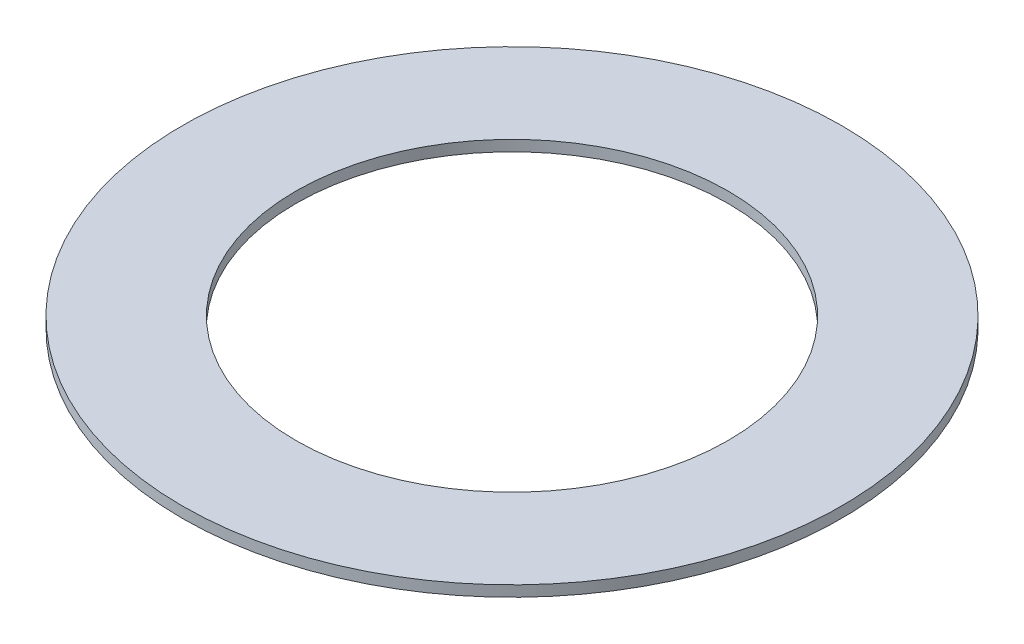
ISO-10303-21;
HEADER;
FILE_DESCRIPTION(('STEP AP214'),'2;1');
FILE_NAME('part.step','',(''),(''),'','','');
FILE_SCHEMA(('AUTOMOTIVE_DESIGN { 1 0 10303 214 1 1 1 1 }'));
ENDSEC;
DATA;
#1=APPLICATION_CONTEXT('core data for automotive mechanical design processes');
#2=APPLICATION_PROTOCOL_DEFINITION('international standard','automotive_design',2000,#1);
#3=PRODUCT_CONTEXT('',#1,'mechanical');
#4=PRODUCT('Part','Part','',(#3));
#5=PRODUCT_RELATED_PRODUCT_CATEGORY('part','',(#4));
#6=PRODUCT_DEFINITION_FORMATION('','',#4);
#7=PRODUCT_DEFINITION_CONTEXT('part definition',#1,'design');
#8=PRODUCT_DEFINITION('design','',#6,#7);
#9=PRODUCT_DEFINITION_SHAPE('','',#8);
#10=(LENGTH_UNIT() NAMED_UNIT(*) SI_UNIT(.MILLI.,.METRE.));
#11=(NAMED_UNIT(*) PLANE_ANGLE_UNIT() SI_UNIT($,.RADIAN.));
#12=(NAMED_UNIT(*) SI_UNIT($,.STERADIAN.) SOLID_ANGLE_UNIT());
#13=UNCERTAINTY_MEASURE_WITH_UNIT(LENGTH_MEASURE(1.E-05),#10,'distance_accuracy_value','');
#14=(GEOMETRIC_REPRESENTATION_CONTEXT(3) GLOBAL_UNCERTAINTY_ASSIGNED_CONTEXT((#13)) GLOBAL_UNIT_ASSIGNED_CONTEXT((#10,
#11,#12)) REPRESENTATION_CONTEXT('',''));
#15=CARTESIAN_POINT('',(0.,0.,0.));
#16=DIRECTION('',(0.,0.,1.));
#17=DIRECTION('',(1.,0.,0.));
#18=AXIS2_PLACEMENT_3D('',#15,#16,#17);
#19=CARTESIAN_POINT('',(0.,1.,0.));
#20=DIRECTION('',(0.,1.,0.));
#21=DIRECTION('',(0.,0.,1.));
#22=AXIS2_PLACEMENT_3D('',#19,#20,#21);
#23=PLANE('',#22);
#24=CARTESIAN_POINT('',(0.,1.,0.));
#25=DIRECTION('',(0.,1.,0.));
#26=DIRECTION('',(0.,0.,1.));
#27=AXIS2_PLACEMENT_3D('',#24,#25,#26);
#28=CIRCLE('',#27,30.5);
#29=CARTESIAN_POINT('',(0.,1.,30.5));
#30=VERTEX_POINT('',#29);
#31=EDGE_CURVE('E10',#30,#30,#28,.T.);
#32=ORIENTED_EDGE('',*,*,#31,.T.);
#33=EDGE_LOOP('',(#32));
#34=FACE_BOUND('',#33,.T.);
#35=CARTESIAN_POINT('',(0.,1.,0.));
#36=DIRECTION('',(0.,1.,0.));
#37=DIRECTION('',(0.,0.,1.));
#38=AXIS2_PLACEMENT_3D('',#35,#36,#37);
#39=CIRCLE('',#38,20.);
#40=CARTESIAN_POINT('',(0.,1.,20.));
#41=VERTEX_POINT('',#40);
#42=EDGE_CURVE('E25',#41,#41,#39,.T.);
#43=ORIENTED_EDGE('',*,*,#42,.F.);
#44=EDGE_LOOP('',(#43));
#45=FACE_BOUND('',#44,.T.);
#46=ADVANCED_FACE('F14',(#34,#45),#23,.T.);
#47=CARTESIAN_POINT('',(0.,0.,0.));
#48=DIRECTION('',(0.,1.,0.));
#49=DIRECTION('',(0.,0.,1.));
#50=AXIS2_PLACEMENT_3D('',#47,#48,#49);
#51=PLANE('',#50);
#52=CARTESIAN_POINT('',(0.,0.,0.));
#53=DIRECTION('',(0.,1.,0.));
#54=DIRECTION('',(0.,0.,1.));
#55=AXIS2_PLACEMENT_3D('',#52,#53,#54);
#56=CIRCLE('',#55,30.5);
#57=CARTESIAN_POINT('',(0.,0.,30.5));
#58=VERTEX_POINT('',#57);
#59=EDGE_CURVE('E18',#58,#58,#56,.T.);
#60=ORIENTED_EDGE('',*,*,#59,.F.);
#61=EDGE_LOOP('',(#60));
#62=FACE_BOUND('',#61,.T.);
#63=CARTESIAN_POINT('',(0.,0.,0.));
#64=DIRECTION('',(0.,1.,0.));
#65=DIRECTION('',(0.,0.,1.));
#66=AXIS2_PLACEMENT_3D('',#63,#64,#65);
#67=CIRCLE('',#66,20.);
#68=CARTESIAN_POINT('',(0.,0.,20.));
#69=VERTEX_POINT('',#68);
#70=EDGE_CURVE('E27',#69,#69,#67,.T.);
#71=ORIENTED_EDGE('',*,*,#70,.T.);
#72=EDGE_LOOP('',(#71));
#73=FACE_BOUND('',#72,.T.);
#74=ADVANCED_FACE('F37',(#62,#73),#51,.F.);
#75=CARTESIAN_POINT('',(0.,1.,0.));
#76=DIRECTION('',(0.,-1.,0.));
#77=DIRECTION('',(0.,0.,-1.));
#78=AXIS2_PLACEMENT_3D('',#75,#76,#77);
#79=CYLINDRICAL_SURFACE('',#78,30.5);
#80=ORIENTED_EDGE('',*,*,#31,.F.);
#81=EDGE_LOOP('',(#80));
#82=FACE_BOUND('',#81,.T.);
#83=ORIENTED_EDGE('',*,*,#59,.T.);
#84=EDGE_LOOP('',(#83));
#85=FACE_BOUND('',#84,.T.);
#86=ADVANCED_FACE('F16',(#82,#85),#79,.T.);
#87=CARTESIAN_POINT('',(0.,1.,0.));
#88=DIRECTION('',(0.,-1.,0.));
#89=DIRECTION('',(0.,0.,-1.));
#90=AXIS2_PLACEMENT_3D('',#87,#88,#89);
#91=CYLINDRICAL_SURFACE('',#90,20.);
#92=ORIENTED_EDGE('',*,*,#42,.T.);
#93=EDGE_LOOP('',(#92));
#94=FACE_BOUND('',#93,.T.);
#95=ORIENTED_EDGE('',*,*,#70,.F.);
#96=EDGE_LOOP('',(#95));
#97=FACE_BOUND('',#96,.T.);
#98=ADVANCED_FACE('F33',(#94,#97),#91,.F.);
#99=CLOSED_SHELL('',(#46,#74,#86,#98));
#100=MANIFOLD_SOLID_BREP('B1',#99);
#101=ADVANCED_BREP_SHAPE_REPRESENTATION('',(#18,#100),#14);
#102=SHAPE_DEFINITION_REPRESENTATION(#9,#101);
ENDSEC;
END-ISO-10303-21;
